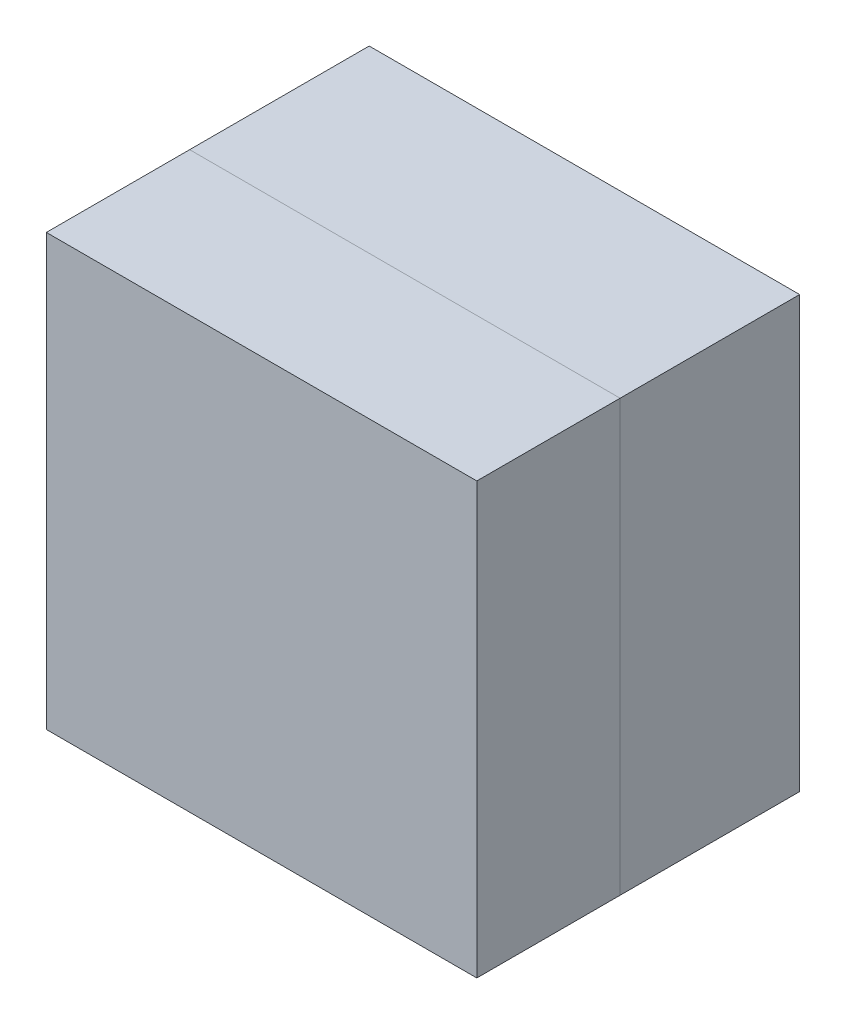
ISO-10303-21;
HEADER;
FILE_DESCRIPTION(('STEP AP214'),'2;1');
FILE_NAME('part.step','',(''),(''),'','','');
FILE_SCHEMA(('AUTOMOTIVE_DESIGN { 1 0 10303 214 1 1 1 1 }'));
ENDSEC;
DATA;
#1=APPLICATION_CONTEXT('core data for automotive mechanical design processes');
#2=APPLICATION_PROTOCOL_DEFINITION('international standard','automotive_design',2000,#1);
#3=PRODUCT_CONTEXT('',#1,'mechanical');
#4=PRODUCT('Part','Part','',(#3));
#5=PRODUCT_RELATED_PRODUCT_CATEGORY('part','',(#4));
#6=PRODUCT_DEFINITION_FORMATION('','',#4);
#7=PRODUCT_DEFINITION_CONTEXT('part definition',#1,'design');
#8=PRODUCT_DEFINITION('design','',#6,#7);
#9=PRODUCT_DEFINITION_SHAPE('','',#8);
#10=(LENGTH_UNIT() NAMED_UNIT(*) SI_UNIT(.MILLI.,.METRE.));
#11=(NAMED_UNIT(*) PLANE_ANGLE_UNIT() SI_UNIT($,.RADIAN.));
#12=(NAMED_UNIT(*) SI_UNIT($,.STERADIAN.) SOLID_ANGLE_UNIT());
#13=UNCERTAINTY_MEASURE_WITH_UNIT(LENGTH_MEASURE(1.E-05),#10,'distance_accuracy_value','');
#14=(GEOMETRIC_REPRESENTATION_CONTEXT(3) GLOBAL_UNCERTAINTY_ASSIGNED_CONTEXT((#13)) GLOBAL_UNIT_ASSIGNED_CONTEXT((#10,
#11,#12)) REPRESENTATION_CONTEXT('',''));
#15=CARTESIAN_POINT('',(0.,0.,0.));
#16=DIRECTION('',(0.,0.,1.));
#17=DIRECTION('',(1.,0.,0.));
#18=AXIS2_PLACEMENT_3D('',#15,#16,#17);
#19=CARTESIAN_POINT('',(0.,-4.61267334725164E-13,127.132943369893));
#20=DIRECTION('',(0.,0.,-1.));
#21=DIRECTION('',(0.,1.,0.));
#22=AXIS2_PLACEMENT_3D('',#19,#20,#21);
#23=PLANE('',#22);
#24=DIRECTION('',(-1.,0.,0.));
#25=VECTOR('',#24,1.);
#26=CARTESIAN_POINT('',(152.4,-152.4,127.132943369892));
#27=LINE('',#26,#25);
#28=CARTESIAN_POINT('',(152.4,-152.4,127.132943369893));
#29=VERTEX_POINT('',#28);
#30=CARTESIAN_POINT('',(-152.4,-152.4,127.132943369892));
#31=VERTEX_POINT('',#30);
#32=EDGE_CURVE('E103',#29,#31,#27,.T.);
#33=ORIENTED_EDGE('',*,*,#32,.T.);
#34=DIRECTION('',(0.,1.,0.));
#35=VECTOR('',#34,1.);
#36=CARTESIAN_POINT('',(-152.4,152.4,127.132943369893));
#37=LINE('',#36,#35);
#38=CARTESIAN_POINT('',(-152.4,152.4,127.132943369893));
#39=VERTEX_POINT('',#38);
#40=EDGE_CURVE('E89',#31,#39,#37,.T.);
#41=ORIENTED_EDGE('',*,*,#40,.T.);
#42=DIRECTION('',(1.,0.,0.));
#43=VECTOR('',#42,1.);
#44=CARTESIAN_POINT('',(152.4,152.4,127.132943369893));
#45=LINE('',#44,#43);
#46=CARTESIAN_POINT('',(152.4,152.4,127.132943369893));
#47=VERTEX_POINT('',#46);
#48=EDGE_CURVE('E101',#39,#47,#45,.T.);
#49=ORIENTED_EDGE('',*,*,#48,.T.);
#50=DIRECTION('',(0.,-1.,0.));
#51=VECTOR('',#50,1.);
#52=CARTESIAN_POINT('',(152.4,152.4,127.132943369893));
#53=LINE('',#52,#51);
#54=EDGE_CURVE('E108',#47,#29,#53,.T.);
#55=ORIENTED_EDGE('',*,*,#54,.T.);
#56=EDGE_LOOP('',(#33,#41,#49,#55));
#57=FACE_BOUND('',#56,.T.);
#58=CARTESIAN_POINT('',(0.90869526163995,-0.0776127525782167,127.132943369893));
#59=DIRECTION('',(0.,0.,1.));
#60=DIRECTION('',(0.,-1.,0.));
#61=AXIS2_PLACEMENT_3D('',#58,#59,#60);
#62=CIRCLE('',#61,91.1860000000005);
#63=CARTESIAN_POINT('',(0.90869526163995,-91.2636127525787,127.132943369892));
#64=VERTEX_POINT('',#63);
#65=EDGE_CURVE('E12',#64,#64,#62,.T.);
#66=ORIENTED_EDGE('',*,*,#65,.T.);
#67=EDGE_LOOP('',(#66));
#68=FACE_BOUND('',#67,.T.);
#69=ADVANCED_FACE('F45',(#57,#68),#23,.T.);
#70=CARTESIAN_POINT('',(0.90869526163995,-138.632902158747,224.450968055005));
#71=DIRECTION('',(0.,0.,-1.));
#72=DIRECTION('',(0.,1.,0.));
#73=AXIS2_PLACEMENT_3D('',#70,#71,#72);
#74=PLANE('',#73);
#75=CARTESIAN_POINT('',(0.90869526163995,-0.0776127525785565,224.450968055006));
#76=DIRECTION('',(0.,0.,1.));
#77=DIRECTION('',(0.,-1.,0.));
#78=AXIS2_PLACEMENT_3D('',#75,#76,#77);
#79=CIRCLE('',#78,138.555289406168);
#80=CARTESIAN_POINT('',(0.90869526163995,-138.632902158747,224.450968055005));
#81=VERTEX_POINT('',#80);
#82=EDGE_CURVE('E144',#81,#81,#79,.T.);
#83=ORIENTED_EDGE('',*,*,#82,.F.);
#84=EDGE_LOOP('',(#83));
#85=FACE_BOUND('',#84,.T.);
#86=ADVANCED_FACE('F158',(#85),#74,.T.);
#87=CARTESIAN_POINT('',(0.90869526163995,-0.0776127525783632,169.085651996013));
#88=DIRECTION('',(0.,0.,1.));
#89=DIRECTION('',(0.,-1.,0.));
#90=AXIS2_PLACEMENT_3D('',#87,#88,#89);
#91=CYLINDRICAL_SURFACE('',#90,138.555289406168);
#92=ORIENTED_EDGE('',*,*,#82,.T.);
#93=EDGE_LOOP('',(#92));
#94=FACE_BOUND('',#93,.T.);
#95=CARTESIAN_POINT('',(0.90869526163995,-0.0776127525785146,212.450968055006));
#96=DIRECTION('',(0.,0.,1.));
#97=DIRECTION('',(0.,-1.,0.));
#98=AXIS2_PLACEMENT_3D('',#95,#96,#97);
#99=CIRCLE('',#98,138.555289406168);
#100=CARTESIAN_POINT('',(0.90869526163995,-138.632902158747,212.450968055005));
#101=VERTEX_POINT('',#100);
#102=EDGE_CURVE('E141',#101,#101,#99,.T.);
#103=ORIENTED_EDGE('',*,*,#102,.F.);
#104=EDGE_LOOP('',(#103));
#105=FACE_BOUND('',#104,.T.);
#106=ADVANCED_FACE('F161',(#94,#105),#91,.F.);
#107=CARTESIAN_POINT('',(0.90869526163995,-0.0776127525785141,212.327662527832));
#108=DIRECTION('',(0.,0.,1.));
#109=DIRECTION('',(0.,-1.,0.));
#110=AXIS2_PLACEMENT_3D('',#107,#108,#109);
#111=TOROIDAL_SURFACE('',#110,134.112,4.44499999999991);
#112=CARTESIAN_POINT('',(0.90869526163995,-0.0776127525784987,207.904943369893));
#113=DIRECTION('',(0.,0.,1.));
#114=DIRECTION('',(0.,-1.,0.));
#115=AXIS2_PLACEMENT_3D('',#112,#113,#114);
#116=CIRCLE('',#115,133.667500000001);
#117=CARTESIAN_POINT('',(0.90869526163995,-133.745112752579,207.904943369892));
#118=VERTEX_POINT('',#117);
#119=EDGE_CURVE('E138',#118,#118,#116,.T.);
#120=ORIENTED_EDGE('',*,*,#119,.F.);
#121=EDGE_LOOP('',(#120));
#122=FACE_BOUND('',#121,.T.);
#123=ORIENTED_EDGE('',*,*,#102,.T.);
#124=EDGE_LOOP('',(#123));
#125=FACE_BOUND('',#124,.T.);
#126=ADVANCED_FACE('F166',(#122,#125),#111,.F.);
#127=CARTESIAN_POINT('',(0.90869526163995,-0.0776127525784766,201.586773144266));
#128=DIRECTION('',(0.,0.,1.));
#129=DIRECTION('',(0.,-1.,0.));
#130=AXIS2_PLACEMENT_3D('',#127,#128,#129);
#131=TOROIDAL_SURFACE('',#130,133.0325,6.34999999999996);
#132=ORIENTED_EDGE('',*,*,#119,.T.);
#133=EDGE_LOOP('',(#132));
#134=FACE_BOUND('',#133,.T.);
#135=CARTESIAN_POINT('',(0.90869526163995,-0.0776127525784766,201.586773144266));
#136=DIRECTION('',(0.,0.,1.));
#137=DIRECTION('',(0.,-1.,0.));
#138=AXIS2_PLACEMENT_3D('',#135,#136,#137);
#139=CIRCLE('',#138,126.6825);
#140=CARTESIAN_POINT('',(0.90869526163995,-126.760112752579,201.586773144265));
#141=VERTEX_POINT('',#140);
#142=EDGE_CURVE('E135',#141,#141,#139,.T.);
#143=ORIENTED_EDGE('',*,*,#142,.F.);
#144=EDGE_LOOP('',(#143));
#145=FACE_BOUND('',#144,.T.);
#146=ADVANCED_FACE('F173',(#134,#145),#131,.T.);
#147=CARTESIAN_POINT('',(0.90869526163995,-0.0776127525783632,169.085651996013));
#148=DIRECTION('',(0.,0.,1.));
#149=DIRECTION('',(0.,-1.,0.));
#150=AXIS2_PLACEMENT_3D('',#147,#148,#149);
#151=CYLINDRICAL_SURFACE('',#150,126.6825);
#152=CARTESIAN_POINT('',(0.90869526163995,-0.0776127525784433,192.029943369893));
#153=DIRECTION('',(0.,0.,1.));
#154=DIRECTION('',(0.,-1.,0.));
#155=AXIS2_PLACEMENT_3D('',#152,#153,#154);
#156=CIRCLE('',#155,126.6825);
#157=CARTESIAN_POINT('',(0.90869526163995,-126.760112752578,192.029943369892));
#158=VERTEX_POINT('',#157);
#159=EDGE_CURVE('E132',#158,#158,#156,.T.);
#160=ORIENTED_EDGE('',*,*,#159,.F.);
#161=EDGE_LOOP('',(#160));
#162=FACE_BOUND('',#161,.T.);
#163=ORIENTED_EDGE('',*,*,#142,.T.);
#164=EDGE_LOOP('',(#163));
#165=FACE_BOUND('',#164,.T.);
#166=ADVANCED_FACE('F177',(#162,#165),#151,.F.);
#167=CARTESIAN_POINT('',(0.90869526163995,-0.0776127525784433,192.029943369893));
#168=DIRECTION('',(0.,0.,1.));
#169=DIRECTION('',(0.,-1.,0.));
#170=AXIS2_PLACEMENT_3D('',#167,#168,#169);
#171=TOROIDAL_SURFACE('',#170,101.2825,25.3999999999999);
#172=CARTESIAN_POINT('',(0.90869526163995,-0.0776127525784355,189.816187504102));
#173=DIRECTION('',(0.,0.,1.));
#174=DIRECTION('',(0.,-1.,0.));
#175=AXIS2_PLACEMENT_3D('',#172,#173,#174);
#176=CIRCLE('',#175,126.58584533153);
#177=CARTESIAN_POINT('',(0.90869526163995,-126.663458084109,189.816187504102));
#178=VERTEX_POINT('',#177);
#179=EDGE_CURVE('E129',#178,#178,#176,.T.);
#180=ORIENTED_EDGE('',*,*,#179,.F.);
#181=EDGE_LOOP('',(#180));
#182=FACE_BOUND('',#181,.T.);
#183=ORIENTED_EDGE('',*,*,#159,.T.);
#184=EDGE_LOOP('',(#183));
#185=FACE_BOUND('',#184,.T.);
#186=ADVANCED_FACE('F181',(#182,#185),#171,.F.);
#187=CARTESIAN_POINT('',(0.90869526163995,-0.0776127525784355,189.816187504102));
#188=DIRECTION('',(0.,0.,1.));
#189=DIRECTION('',(0.,-1.,0.));
#190=AXIS2_PLACEMENT_3D('',#187,#188,#189);
#191=CONICAL_SURFACE('',#190,126.58584533153,0.0872664625997177);
#192=CARTESIAN_POINT('',(0.90869526163995,-0.0776127525783878,176.154943369893));
#193=DIRECTION('',(0.,0.,1.));
#194=DIRECTION('',(0.,-1.,0.));
#195=AXIS2_PLACEMENT_3D('',#192,#193,#194);
#196=CIRCLE('',#195,125.390641340127);
#197=CARTESIAN_POINT('',(0.90869526163995,-125.468254092705,176.154943369892));
#198=VERTEX_POINT('',#197);
#199=EDGE_CURVE('E126',#198,#198,#196,.T.);
#200=ORIENTED_EDGE('',*,*,#199,.F.);
#201=EDGE_LOOP('',(#200));
#202=FACE_BOUND('',#201,.T.);
#203=ORIENTED_EDGE('',*,*,#179,.T.);
#204=EDGE_LOOP('',(#203));
#205=FACE_BOUND('',#204,.T.);
#206=ADVANCED_FACE('F185',(#202,#205),#191,.F.);
#207=CARTESIAN_POINT('',(0.90869526163995,-0.0776127525783936,177.815260269235));
#208=DIRECTION('',(0.,0.,1.));
#209=DIRECTION('',(0.,-1.,0.));
#210=AXIS2_PLACEMENT_3D('',#207,#208,#209);
#211=TOROIDAL_SURFACE('',#210,106.413132341479,19.05);
#212=CARTESIAN_POINT('',(0.90869526163995,-0.0776127525783566,167.222414925144));
#213=DIRECTION('',(0.,0.,1.));
#214=DIRECTION('',(0.,-1.,0.));
#215=AXIS2_PLACEMENT_3D('',#212,#213,#214);
#216=CIRCLE('',#215,122.246455666548);
#217=CARTESIAN_POINT('',(0.90869526163995,-122.324068419126,167.222414925144));
#218=VERTEX_POINT('',#217);
#219=EDGE_CURVE('E123',#218,#218,#216,.T.);
#220=ORIENTED_EDGE('',*,*,#219,.F.);
#221=EDGE_LOOP('',(#220));
#222=FACE_BOUND('',#221,.T.);
#223=ORIENTED_EDGE('',*,*,#199,.T.);
#224=EDGE_LOOP('',(#223));
#225=FACE_BOUND('',#224,.T.);
#226=ADVANCED_FACE('F189',(#222,#225),#211,.F.);
#227=CARTESIAN_POINT('',(0.90869526163995,-0.0776127525783566,167.222414925144));
#228=DIRECTION('',(0.,0.,1.));
#229=DIRECTION('',(0.,-1.,0.));
#230=AXIS2_PLACEMENT_3D('',#227,#228,#229);
#231=CONICAL_SURFACE('',#230,122.246455666548,0.58963160852596);
#232=CARTESIAN_POINT('',(0.90869526163995,-0.077612752578229,130.656757809854));
#233=DIRECTION('',(0.,0.,1.));
#234=DIRECTION('',(0.,-1.,0.));
#235=AXIS2_PLACEMENT_3D('',#232,#233,#234);
#236=CIRCLE('',#235,97.7832180521123);
#237=CARTESIAN_POINT('',(0.90869526163995,-97.8608308046906,130.656757809854));
#238=VERTEX_POINT('',#237);
#239=EDGE_CURVE('E54',#238,#238,#236,.T.);
#240=ORIENTED_EDGE('',*,*,#239,.F.);
#241=EDGE_LOOP('',(#240));
#242=FACE_BOUND('',#241,.T.);
#243=ORIENTED_EDGE('',*,*,#219,.T.);
#244=EDGE_LOOP('',(#243));
#245=FACE_BOUND('',#244,.T.);
#246=ADVANCED_FACE('F193',(#242,#245),#231,.F.);
#247=CARTESIAN_POINT('',(0.90869526163995,-0.0776127525782444,135.070443369893));
#248=DIRECTION('',(0.,0.,1.));
#249=DIRECTION('',(0.,-1.,0.));
#250=AXIS2_PLACEMENT_3D('',#247,#248,#249);
#251=TOROIDAL_SURFACE('',#250,91.1860000000004,7.93750000000004);
#252=ORIENTED_EDGE('',*,*,#65,.F.);
#253=EDGE_LOOP('',(#252));
#254=FACE_BOUND('',#253,.T.);
#255=ORIENTED_EDGE('',*,*,#239,.T.);
#256=EDGE_LOOP('',(#255));
#257=FACE_BOUND('',#256,.T.);
#258=ADVANCED_FACE('F197',(#254,#257),#251,.F.);
#259=CARTESIAN_POINT('',(-152.4,152.4,228.6));
#260=DIRECTION('',(1.,0.,0.));
#261=DIRECTION('',(0.,1.,0.));
#262=AXIS2_PLACEMENT_3D('',#259,#260,#261);
#263=PLANE('',#262);
#264=ORIENTED_EDGE('',*,*,#40,.F.);
#265=DIRECTION('',(0.,0.,-1.));
#266=VECTOR('',#265,1.);
#267=CARTESIAN_POINT('',(-152.4,-152.4,228.6));
#268=LINE('',#267,#266);
#269=CARTESIAN_POINT('',(-152.4,-152.4,228.6));
#270=VERTEX_POINT('',#269);
#271=EDGE_CURVE('E104',#270,#31,#268,.T.);
#272=ORIENTED_EDGE('',*,*,#271,.F.);
#273=DIRECTION('',(0.,-1.,0.));
#274=VECTOR('',#273,1.);
#275=CARTESIAN_POINT('',(-152.4,152.4,228.6));
#276=LINE('',#275,#274);
#277=CARTESIAN_POINT('',(-152.4,152.4,228.6));
#278=VERTEX_POINT('',#277);
#279=EDGE_CURVE('E91',#278,#270,#276,.T.);
#280=ORIENTED_EDGE('',*,*,#279,.F.);
#281=DIRECTION('',(0.,0.,-1.));
#282=VECTOR('',#281,1.);
#283=CARTESIAN_POINT('',(-152.4,152.4,228.6));
#284=LINE('',#283,#282);
#285=EDGE_CURVE('E49',#278,#39,#284,.T.);
#286=ORIENTED_EDGE('',*,*,#285,.T.);
#287=EDGE_LOOP('',(#264,#272,#280,#286));
#288=FACE_BOUND('',#287,.T.);
#289=ADVANCED_FACE('F87',(#288),#263,.F.);
#290=CARTESIAN_POINT('',(152.4,-152.4,228.6));
#291=DIRECTION('',(0.,1.,0.));
#292=DIRECTION('',(-1.,0.,0.));
#293=AXIS2_PLACEMENT_3D('',#290,#291,#292);
#294=PLANE('',#293);
#295=ORIENTED_EDGE('',*,*,#32,.F.);
#296=DIRECTION('',(0.,0.,-1.));
#297=VECTOR('',#296,1.);
#298=CARTESIAN_POINT('',(152.4,-152.4,228.6));
#299=LINE('',#298,#297);
#300=CARTESIAN_POINT('',(152.4,-152.4,228.6));
#301=VERTEX_POINT('',#300);
#302=EDGE_CURVE('E114',#301,#29,#299,.T.);
#303=ORIENTED_EDGE('',*,*,#302,.F.);
#304=DIRECTION('',(1.,0.,0.));
#305=VECTOR('',#304,1.);
#306=CARTESIAN_POINT('',(152.4,-152.4,228.6));
#307=LINE('',#306,#305);
#308=EDGE_CURVE('E62',#270,#301,#307,.T.);
#309=ORIENTED_EDGE('',*,*,#308,.F.);
#310=ORIENTED_EDGE('',*,*,#271,.T.);
#311=EDGE_LOOP('',(#295,#303,#309,#310));
#312=FACE_BOUND('',#311,.T.);
#313=ADVANCED_FACE('F119',(#312),#294,.F.);
#314=CARTESIAN_POINT('',(152.4,152.4,228.6));
#315=DIRECTION('',(-1.,0.,0.));
#316=DIRECTION('',(0.,-1.,0.));
#317=AXIS2_PLACEMENT_3D('',#314,#315,#316);
#318=PLANE('',#317);
#319=ORIENTED_EDGE('',*,*,#54,.F.);
#320=DIRECTION('',(0.,0.,-1.));
#321=VECTOR('',#320,1.);
#322=CARTESIAN_POINT('',(152.4,152.4,228.6));
#323=LINE('',#322,#321);
#324=CARTESIAN_POINT('',(152.4,152.4,228.6));
#325=VERTEX_POINT('',#324);
#326=EDGE_CURVE('E96',#325,#47,#323,.T.);
#327=ORIENTED_EDGE('',*,*,#326,.F.);
#328=DIRECTION('',(0.,1.,0.));
#329=VECTOR('',#328,1.);
#330=CARTESIAN_POINT('',(152.4,152.4,228.6));
#331=LINE('',#330,#329);
#332=EDGE_CURVE('E118',#301,#325,#331,.T.);
#333=ORIENTED_EDGE('',*,*,#332,.F.);
#334=ORIENTED_EDGE('',*,*,#302,.T.);
#335=EDGE_LOOP('',(#319,#327,#333,#334));
#336=FACE_BOUND('',#335,.T.);
#337=ADVANCED_FACE('F117',(#336),#318,.F.);
#338=CARTESIAN_POINT('',(152.4,152.4,228.6));
#339=DIRECTION('',(0.,-1.,0.));
#340=DIRECTION('',(1.,0.,0.));
#341=AXIS2_PLACEMENT_3D('',#338,#339,#340);
#342=PLANE('',#341);
#343=ORIENTED_EDGE('',*,*,#48,.F.);
#344=ORIENTED_EDGE('',*,*,#285,.F.);
#345=DIRECTION('',(-1.,0.,0.));
#346=VECTOR('',#345,1.);
#347=CARTESIAN_POINT('',(152.4,152.4,228.6));
#348=LINE('',#347,#346);
#349=EDGE_CURVE('E95',#325,#278,#348,.T.);
#350=ORIENTED_EDGE('',*,*,#349,.F.);
#351=ORIENTED_EDGE('',*,*,#326,.T.);
#352=EDGE_LOOP('',(#343,#344,#350,#351));
#353=FACE_BOUND('',#352,.T.);
#354=ADVANCED_FACE('F47',(#353),#342,.F.);
#355=CARTESIAN_POINT('',(0.,0.,228.6));
#356=DIRECTION('',(0.,0.,-1.));
#357=DIRECTION('',(-1.,0.,0.));
#358=AXIS2_PLACEMENT_3D('',#355,#356,#357);
#359=PLANE('',#358);
#360=ORIENTED_EDGE('',*,*,#279,.T.);
#361=ORIENTED_EDGE('',*,*,#308,.T.);
#362=ORIENTED_EDGE('',*,*,#332,.T.);
#363=ORIENTED_EDGE('',*,*,#349,.T.);
#364=EDGE_LOOP('',(#360,#361,#362,#363));
#365=FACE_BOUND('',#364,.T.);
#366=ADVANCED_FACE('F150',(#365),#359,.F.);
#367=CLOSED_SHELL('',(#69,#86,#106,#126,#146,#166,#186,#206,#226,#246,#258,#289,#313,#337,#354,#366));
#368=MANIFOLD_SOLID_BREP('B2',#367);
#369=CARTESIAN_POINT('',(0.,-4.61267334725164E-13,127.132943369893));
#370=DIRECTION('',(0.,0.,-1.));
#371=DIRECTION('',(0.,1.,0.));
#372=AXIS2_PLACEMENT_3D('',#369,#370,#371);
#373=PLANE('',#372);
#374=CARTESIAN_POINT('',(0.90869526163995,-0.0776127525782167,127.132943369893));
#375=DIRECTION('',(0.,0.,1.));
#376=DIRECTION('',(0.,-1.,0.));
#377=AXIS2_PLACEMENT_3D('',#374,#375,#376);
#378=CIRCLE('',#377,91.7987750000028);
#379=CARTESIAN_POINT('',(0.90869526163995,-91.876387752581,127.132943369892));
#380=VERTEX_POINT('',#379);
#381=EDGE_CURVE('E384',#380,#380,#378,.T.);
#382=ORIENTED_EDGE('',*,*,#381,.F.);
#383=EDGE_LOOP('',(#382));
#384=FACE_BOUND('',#383,.T.);
#385=DIRECTION('',(-1.,0.,0.));
#386=VECTOR('',#385,1.);
#387=CARTESIAN_POINT('',(152.4,-152.4,127.132943369892));
#388=LINE('',#387,#386);
#389=CARTESIAN_POINT('',(152.4,-152.4,127.132943369893));
#390=VERTEX_POINT('',#389);
#391=CARTESIAN_POINT('',(-152.4,-152.4,127.132943369892));
#392=VERTEX_POINT('',#391);
#393=EDGE_CURVE('E329',#390,#392,#388,.T.);
#394=ORIENTED_EDGE('',*,*,#393,.F.);
#395=DIRECTION('',(0.,-1.,0.));
#396=VECTOR('',#395,1.);
#397=CARTESIAN_POINT('',(152.4,152.4,127.132943369893));
#398=LINE('',#397,#396);
#399=CARTESIAN_POINT('',(152.4,152.4,127.132943369893));
#400=VERTEX_POINT('',#399);
#401=EDGE_CURVE('E342',#400,#390,#398,.T.);
#402=ORIENTED_EDGE('',*,*,#401,.F.);
#403=DIRECTION('',(1.,0.,0.));
#404=VECTOR('',#403,1.);
#405=CARTESIAN_POINT('',(152.4,152.4,127.132943369893));
#406=LINE('',#405,#404);
#407=CARTESIAN_POINT('',(-152.4,152.4,127.132943369893));
#408=VERTEX_POINT('',#407);
#409=EDGE_CURVE('E369',#408,#400,#406,.T.);
#410=ORIENTED_EDGE('',*,*,#409,.F.);
#411=DIRECTION('',(0.,1.,0.));
#412=VECTOR('',#411,1.);
#413=CARTESIAN_POINT('',(-152.4,152.4,127.132943369893));
#414=LINE('',#413,#412);
#415=EDGE_CURVE('E43',#392,#408,#414,.T.);
#416=ORIENTED_EDGE('',*,*,#415,.F.);
#417=EDGE_LOOP('',(#394,#402,#410,#416));
#418=FACE_BOUND('',#417,.T.);
#419=ADVANCED_FACE('F322',(#384,#418),#373,.F.);
#420=CARTESIAN_POINT('',(0.90869526163995,-91.876387752581,127.132943369892));
#421=CARTESIAN_POINT('',(0.90869526163995,-94.6834634015012,127.132943369892));
#422=CARTESIAN_POINT('',(0.90869526163995,-97.40004583746,126.518818236651));
#423=CARTESIAN_POINT('',(0.90869526163995,-99.903113005087,125.348106712939));
#424=(BOUNDED_CURVE() B_SPLINE_CURVE(3,(#420,#421,#422,#423),.UNSPECIFIED.,.F.,
.F.) B_SPLINE_CURVE_WITH_KNOTS((4,4),(0.,1.),
.UNSPECIFIED.) CURVE() GEOMETRIC_REPRESENTATION_ITEM() RATIONAL_B_SPLINE_CURVE((0.254333095030252,
0.254333095030252,0.258499793724843,0.266833191114025)) REPRESENTATION_ITEM(''));
#425=CARTESIAN_POINT('',(0.90869526163995,-0.0776127525783632,169.085651996013));
#426=DIRECTION('',(0.,0.,1.));
#427=AXIS1_PLACEMENT('',#425,#426);
#428=SURFACE_OF_REVOLUTION('',#424,#427);
#429=CARTESIAN_POINT('',(0.90869526163995,-0.0776127525782104,125.348106712939));
#430=DIRECTION('',(0.,0.,1.));
#431=DIRECTION('',(0.,-1.,0.));
#432=AXIS2_PLACEMENT_3D('',#429,#430,#431);
#433=CIRCLE('',#432,99.8255002525088);
#434=CARTESIAN_POINT('',(0.90869526163995,-99.903113005087,125.348106712939));
#435=VERTEX_POINT('',#434);
#436=EDGE_CURVE('E387',#435,#435,#433,.T.);
#437=ORIENTED_EDGE('',*,*,#436,.F.);
#438=EDGE_LOOP('',(#437));
#439=FACE_BOUND('',#438,.T.);
#440=ORIENTED_EDGE('',*,*,#381,.T.);
#441=EDGE_LOOP('',(#440));
#442=FACE_BOUND('',#441,.T.);
#443=ADVANCED_FACE('F412',(#439,#442),#428,.T.);
#444=CARTESIAN_POINT('',(0.90869526163995,-0.077612752578179,116.353347557886));
#445=DIRECTION('',(0.,0.,-1.));
#446=DIRECTION('',(0.,1.,0.));
#447=AXIS2_PLACEMENT_3D('',#444,#445,#446);
#448=CONICAL_SURFACE('',#447,119.056955539065,1.13331210913777);
#449=ORIENTED_EDGE('',*,*,#436,.T.);
#450=EDGE_LOOP('',(#449));
#451=FACE_BOUND('',#450,.T.);
#452=CARTESIAN_POINT('',(0.90869526163995,-0.077612752578179,116.353347557886));
#453=DIRECTION('',(0.,0.,1.));
#454=DIRECTION('',(0.,-1.,0.));
#455=AXIS2_PLACEMENT_3D('',#452,#453,#454);
#456=CIRCLE('',#455,119.056955539065);
#457=CARTESIAN_POINT('',(0.90869526163995,-119.134568291643,116.353347557886));
#458=VERTEX_POINT('',#457);
#459=EDGE_CURVE('E460',#458,#458,#456,.T.);
#460=ORIENTED_EDGE('',*,*,#459,.F.);
#461=EDGE_LOOP('',(#460));
#462=FACE_BOUND('',#461,.T.);
#463=ADVANCED_FACE('F417',(#451,#462),#448,.F.);
#464=CARTESIAN_POINT('',(0.90869526163995,-0.0776127525781537,109.10678459855));
#465=DIRECTION('',(0.,0.,1.));
#466=DIRECTION('',(0.,-1.,0.));
#467=AXIS2_PLACEMENT_3D('',#464,#465,#466);
#468=TOROIDAL_SURFACE('',#467,115.667659848753,8.);
#469=ORIENTED_EDGE('',*,*,#459,.T.);
#470=EDGE_LOOP('',(#469));
#471=FACE_BOUND('',#470,.T.);
#472=CARTESIAN_POINT('',(0.90869526163995,-0.0776127525781548,109.41388707125));
#473=DIRECTION('',(0.,0.,1.));
#474=DIRECTION('',(0.,-1.,0.));
#475=AXIS2_PLACEMENT_3D('',#472,#473,#474);
#476=CIRCLE('',#475,123.661763180038);
#477=CARTESIAN_POINT('',(0.90869526163995,-123.739375932616,109.413887071249));
#478=VERTEX_POINT('',#477);
#479=EDGE_CURVE('E457',#478,#478,#476,.T.);
#480=ORIENTED_EDGE('',*,*,#479,.F.);
#481=EDGE_LOOP('',(#480));
#482=FACE_BOUND('',#481,.T.);
#483=ADVANCED_FACE('F468',(#471,#482),#468,.F.);
#484=CARTESIAN_POINT('',(0.90869526163995,-0.0776127525779172,41.3463400319306));
#485=DIRECTION('',(0.,0.,-1.));
#486=DIRECTION('',(0.,1.,0.));
#487=AXIS2_PLACEMENT_3D('',#484,#485,#486);
#488=CONICAL_SURFACE('',#487,126.276654574374,0.0383972435438753);
#489=ORIENTED_EDGE('',*,*,#479,.T.);
#490=EDGE_LOOP('',(#489));
#491=FACE_BOUND('',#490,.T.);
#492=CARTESIAN_POINT('',(0.90869526163995,-0.0776127525779172,41.3463400319306));
#493=DIRECTION('',(0.,0.,1.));
#494=DIRECTION('',(0.,-1.,0.));
#495=AXIS2_PLACEMENT_3D('',#492,#493,#494);
#496=CIRCLE('',#495,126.276654574374);
#497=CARTESIAN_POINT('',(0.90869526163995,-126.354267326952,41.3463400319301));
#498=VERTEX_POINT('',#497);
#499=EDGE_CURVE('E454',#498,#498,#496,.T.);
#500=ORIENTED_EDGE('',*,*,#499,.F.);
#501=EDGE_LOOP('',(#500));
#502=FACE_BOUND('',#501,.T.);
#503=ADVANCED_FACE('F473',(#491,#502),#488,.F.);
#504=CARTESIAN_POINT('',(0.90869526163995,-0.0776127525779125,40.0027667138672));
#505=DIRECTION('',(0.,0.,1.));
#506=DIRECTION('',(0.,-1.,0.));
#507=AXIS2_PLACEMENT_3D('',#504,#505,#506);
#508=TOROIDAL_SURFACE('',#507,91.302452500002,35.);
#509=ORIENTED_EDGE('',*,*,#499,.T.);
#510=EDGE_LOOP('',(#509));
#511=FACE_BOUND('',#510,.T.);
#512=CARTESIAN_POINT('',(0.90869526163995,-0.0776127525779125,40.0027667138671));
#513=DIRECTION('',(0.,0.,1.));
#514=DIRECTION('',(0.,-1.,0.));
#515=AXIS2_PLACEMENT_3D('',#512,#513,#514);
#516=CIRCLE('',#515,126.302452500002);
#517=CARTESIAN_POINT('',(0.90869526163995,-126.38006525258,40.0027667138667));
#518=VERTEX_POINT('',#517);
#519=EDGE_CURVE('E451',#518,#518,#516,.T.);
#520=ORIENTED_EDGE('',*,*,#519,.F.);
#521=EDGE_LOOP('',(#520));
#522=FACE_BOUND('',#521,.T.);
#523=ADVANCED_FACE('F478',(#511,#522),#508,.F.);
#524=CARTESIAN_POINT('',(0.90869526163995,-0.0776127525783632,169.085651996013));
#525=DIRECTION('',(0.,0.,1.));
#526=DIRECTION('',(0.,-1.,0.));
#527=AXIS2_PLACEMENT_3D('',#524,#525,#526);
#528=CYLINDRICAL_SURFACE('',#527,126.302452500002);
#529=CARTESIAN_POINT('',(0.90869526163995,-0.0776127525778679,27.2484054174911));
#530=DIRECTION('',(0.,0.,1.));
#531=DIRECTION('',(0.,-1.,0.));
#532=AXIS2_PLACEMENT_3D('',#529,#530,#531);
#533=CIRCLE('',#532,126.302452500002);
#534=CARTESIAN_POINT('',(0.90869526163995,-126.38006525258,27.2484054174907));
#535=VERTEX_POINT('',#534);
#536=EDGE_CURVE('E448',#535,#535,#533,.T.);
#537=ORIENTED_EDGE('',*,*,#536,.F.);
#538=EDGE_LOOP('',(#537));
#539=FACE_BOUND('',#538,.T.);
#540=ORIENTED_EDGE('',*,*,#519,.T.);
#541=EDGE_LOOP('',(#540));
#542=FACE_BOUND('',#541,.T.);
#543=ADVANCED_FACE('F484',(#539,#542),#528,.F.);
#544=CARTESIAN_POINT('',(0.90869526163995,-133.59734825258,20.9609433698914));
#545=CARTESIAN_POINT('',(0.90869526163995,-128.912310640584,20.2965209052261));
#546=CARTESIAN_POINT('',(0.90869526163995,-126.38006525258,23.7261671924004));
#547=CARTESIAN_POINT('',(0.90869526163995,-126.38006525258,27.2484054174907));
#548=(BOUNDED_CURVE() B_SPLINE_CURVE(3,(#544,#545,#546,#547),.UNSPECIFIED.,.F.,
.F.) B_SPLINE_CURVE_WITH_KNOTS((4,4),(0.,1.),
.UNSPECIFIED.) CURVE() GEOMETRIC_REPRESENTATION_ITEM() RATIONAL_B_SPLINE_CURVE((0.255591691964593,
0.242825015050018,0.327183181081988,0.508666190060503)) REPRESENTATION_ITEM(''));
#549=CARTESIAN_POINT('',(0.90869526163995,-0.0776127525783632,169.085651996013));
#550=DIRECTION('',(0.,0.,1.));
#551=AXIS1_PLACEMENT('',#549,#550);
#552=SURFACE_OF_REVOLUTION('',#548,#551);
#553=ORIENTED_EDGE('',*,*,#536,.T.);
#554=EDGE_LOOP('',(#553));
#555=FACE_BOUND('',#554,.T.);
#556=CARTESIAN_POINT('',(0.90869526163995,-0.077612752577846,20.9609433698918));
#557=DIRECTION('',(0.,0.,1.));
#558=DIRECTION('',(0.,-1.,0.));
#559=AXIS2_PLACEMENT_3D('',#556,#557,#558);
#560=CIRCLE('',#559,133.519735500002);
#561=CARTESIAN_POINT('',(0.90869526163995,-133.59734825258,20.9609433698914));
#562=VERTEX_POINT('',#561);
#563=EDGE_CURVE('E445',#562,#562,#560,.T.);
#564=ORIENTED_EDGE('',*,*,#563,.F.);
#565=EDGE_LOOP('',(#564));
#566=FACE_BOUND('',#565,.T.);
#567=ADVANCED_FACE('F489',(#555,#566),#552,.F.);
#568=CARTESIAN_POINT('',(0.90869526163995,-133.59734825258,20.9609433698914));
#569=CARTESIAN_POINT('',(0.90869526163995,-136.783173828737,21.4127506458637));
#570=CARTESIAN_POINT('',(0.90869526163995,-138.50510069258,19.0805911705852));
#571=CARTESIAN_POINT('',(0.90869526163995,-138.50510069258,16.685469177524));
#572=(BOUNDED_CURVE() B_SPLINE_CURVE(3,(#568,#569,#570,#571),.UNSPECIFIED.,.F.,
.F.) B_SPLINE_CURVE_WITH_KNOTS((4,4),(0.,1.),
.UNSPECIFIED.) CURVE() GEOMETRIC_REPRESENTATION_ITEM() RATIONAL_B_SPLINE_CURVE((0.255591691964592,
0.242825015050017,0.327183181081988,0.508666190060503)) REPRESENTATION_ITEM(''));
#573=CARTESIAN_POINT('',(0.90869526163995,-0.0776127525783632,169.085651996013));
#574=DIRECTION('',(0.,0.,1.));
#575=AXIS1_PLACEMENT('',#573,#574);
#576=SURFACE_OF_REVOLUTION('',#572,#575);
#577=CARTESIAN_POINT('',(0.90869526163995,-0.0776127525778311,16.6854691775245));
#578=DIRECTION('',(0.,0.,1.));
#579=DIRECTION('',(0.,-1.,0.));
#580=AXIS2_PLACEMENT_3D('',#577,#578,#579);
#581=CIRCLE('',#580,138.427487940002);
#582=CARTESIAN_POINT('',(0.90869526163995,-138.50510069258,16.685469177524));
#583=VERTEX_POINT('',#582);
#584=EDGE_CURVE('E442',#583,#583,#581,.T.);
#585=ORIENTED_EDGE('',*,*,#584,.F.);
#586=EDGE_LOOP('',(#585));
#587=FACE_BOUND('',#586,.T.);
#588=ORIENTED_EDGE('',*,*,#563,.T.);
#589=EDGE_LOOP('',(#588));
#590=FACE_BOUND('',#589,.T.);
#591=ADVANCED_FACE('F495',(#587,#590),#576,.T.);
#592=CARTESIAN_POINT('',(0.90869526163995,-0.0776127525783632,169.085651996013));
#593=DIRECTION('',(0.,0.,1.));
#594=DIRECTION('',(0.,-1.,0.));
#595=AXIS2_PLACEMENT_3D('',#592,#593,#594);
#596=CYLINDRICAL_SURFACE('',#595,138.427487940002);
#597=CARTESIAN_POINT('',(0.90869526163995,-0.0776127525777892,4.68546917752451));
#598=DIRECTION('',(0.,0.,1.));
#599=DIRECTION('',(0.,-1.,0.));
#600=AXIS2_PLACEMENT_3D('',#597,#598,#599);
#601=CIRCLE('',#600,138.427487940002);
#602=CARTESIAN_POINT('',(0.90869526163995,-138.50510069258,4.68546917752402));
#603=VERTEX_POINT('',#602);
#604=EDGE_CURVE('E436',#603,#603,#601,.T.);
#605=ORIENTED_EDGE('',*,*,#604,.F.);
#606=EDGE_LOOP('',(#605));
#607=FACE_BOUND('',#606,.T.);
#608=ORIENTED_EDGE('',*,*,#584,.T.);
#609=EDGE_LOOP('',(#608));
#610=FACE_BOUND('',#609,.T.);
#611=ADVANCED_FACE('F502',(#607,#610),#596,.F.);
#612=CARTESIAN_POINT('',(0.90869526163995,-138.50510069258,4.68546917752402));
#613=DIRECTION('',(0.,0.,-1.));
#614=DIRECTION('',(0.,1.,0.));
#615=AXIS2_PLACEMENT_3D('',#612,#613,#614);
#616=PLANE('',#615);
#617=ORIENTED_EDGE('',*,*,#604,.T.);
#618=EDGE_LOOP('',(#617));
#619=FACE_BOUND('',#618,.T.);
#620=ADVANCED_FACE('F512',(#619),#616,.F.);
#621=CARTESIAN_POINT('',(152.4,-152.4,228.6));
#622=DIRECTION('',(0.,1.,0.));
#623=DIRECTION('',(-1.,0.,0.));
#624=AXIS2_PLACEMENT_3D('',#621,#622,#623);
#625=PLANE('',#624);
#626=DIRECTION('',(0.,0.,-1.));
#627=VECTOR('',#626,1.);
#628=CARTESIAN_POINT('',(152.4,-152.4,228.6));
#629=LINE('',#628,#627);
#630=CARTESIAN_POINT('',(152.4,-152.4,0.));
#631=VERTEX_POINT('',#630);
#632=EDGE_CURVE('E370',#390,#631,#629,.T.);
#633=ORIENTED_EDGE('',*,*,#632,.F.);
#634=ORIENTED_EDGE('',*,*,#393,.T.);
#635=DIRECTION('',(0.,0.,-1.));
#636=VECTOR('',#635,1.);
#637=CARTESIAN_POINT('',(-152.4,-152.4,228.6));
#638=LINE('',#637,#636);
#639=CARTESIAN_POINT('',(-152.4,-152.4,0.));
#640=VERTEX_POINT('',#639);
#641=EDGE_CURVE('E361',#392,#640,#638,.T.);
#642=ORIENTED_EDGE('',*,*,#641,.T.);
#643=DIRECTION('',(1.,0.,0.));
#644=VECTOR('',#643,1.);
#645=CARTESIAN_POINT('',(152.4,-152.4,0.));
#646=LINE('',#645,#644);
#647=EDGE_CURVE('E365',#640,#631,#646,.T.);
#648=ORIENTED_EDGE('',*,*,#647,.T.);
#649=EDGE_LOOP('',(#633,#634,#642,#648));
#650=FACE_BOUND('',#649,.T.);
#651=ADVANCED_FACE('F364',(#650),#625,.F.);
#652=CARTESIAN_POINT('',(0.,0.,0.));
#653=DIRECTION('',(0.,0.,-1.));
#654=DIRECTION('',(-1.,0.,0.));
#655=AXIS2_PLACEMENT_3D('',#652,#653,#654);
#656=PLANE('',#655);
#657=DIRECTION('',(0.,-1.,0.));
#658=VECTOR('',#657,1.);
#659=CARTESIAN_POINT('',(-152.4,152.4,0.));
#660=LINE('',#659,#658);
#661=CARTESIAN_POINT('',(-152.4,152.4,0.));
#662=VERTEX_POINT('',#661);
#663=EDGE_CURVE('E376',#662,#640,#660,.T.);
#664=ORIENTED_EDGE('',*,*,#663,.F.);
#665=DIRECTION('',(-1.,0.,0.));
#666=VECTOR('',#665,1.);
#667=CARTESIAN_POINT('',(152.4,152.4,0.));
#668=LINE('',#667,#666);
#669=CARTESIAN_POINT('',(152.4,152.4,0.));
#670=VERTEX_POINT('',#669);
#671=EDGE_CURVE('E392',#670,#662,#668,.T.);
#672=ORIENTED_EDGE('',*,*,#671,.F.);
#673=DIRECTION('',(0.,1.,0.));
#674=VECTOR('',#673,1.);
#675=CARTESIAN_POINT('',(152.4,152.4,0.));
#676=LINE('',#675,#674);
#677=EDGE_CURVE('E378',#631,#670,#676,.T.);
#678=ORIENTED_EDGE('',*,*,#677,.F.);
#679=ORIENTED_EDGE('',*,*,#647,.F.);
#680=EDGE_LOOP('',(#664,#672,#678,#679));
#681=FACE_BOUND('',#680,.T.);
#682=ADVANCED_FACE('F374',(#681),#656,.T.);
#683=CARTESIAN_POINT('',(152.4,152.4,228.6));
#684=DIRECTION('',(-1.,0.,0.));
#685=DIRECTION('',(0.,-1.,0.));
#686=AXIS2_PLACEMENT_3D('',#683,#684,#685);
#687=PLANE('',#686);
#688=DIRECTION('',(0.,0.,-1.));
#689=VECTOR('',#688,1.);
#690=CARTESIAN_POINT('',(152.4,152.4,228.6));
#691=LINE('',#690,#689);
#692=EDGE_CURVE('E395',#400,#670,#691,.T.);
#693=ORIENTED_EDGE('',*,*,#692,.F.);
#694=ORIENTED_EDGE('',*,*,#401,.T.);
#695=ORIENTED_EDGE('',*,*,#632,.T.);
#696=ORIENTED_EDGE('',*,*,#677,.T.);
#697=EDGE_LOOP('',(#693,#694,#695,#696));
#698=FACE_BOUND('',#697,.T.);
#699=ADVANCED_FACE('F401',(#698),#687,.F.);
#700=CARTESIAN_POINT('',(-152.4,152.4,228.6));
#701=DIRECTION('',(1.,0.,0.));
#702=DIRECTION('',(0.,1.,0.));
#703=AXIS2_PLACEMENT_3D('',#700,#701,#702);
#704=PLANE('',#703);
#705=ORIENTED_EDGE('',*,*,#641,.F.);
#706=ORIENTED_EDGE('',*,*,#415,.T.);
#707=DIRECTION('',(0.,0.,-1.));
#708=VECTOR('',#707,1.);
#709=CARTESIAN_POINT('',(-152.4,152.4,228.6));
#710=LINE('',#709,#708);
#711=EDGE_CURVE('E382',#408,#662,#710,.T.);
#712=ORIENTED_EDGE('',*,*,#711,.T.);
#713=ORIENTED_EDGE('',*,*,#663,.T.);
#714=EDGE_LOOP('',(#705,#706,#712,#713));
#715=FACE_BOUND('',#714,.T.);
#716=ADVANCED_FACE('F380',(#715),#704,.F.);
#717=CARTESIAN_POINT('',(152.4,152.4,228.6));
#718=DIRECTION('',(0.,-1.,0.));
#719=DIRECTION('',(1.,0.,0.));
#720=AXIS2_PLACEMENT_3D('',#717,#718,#719);
#721=PLANE('',#720);
#722=ORIENTED_EDGE('',*,*,#711,.F.);
#723=ORIENTED_EDGE('',*,*,#409,.T.);
#724=ORIENTED_EDGE('',*,*,#692,.T.);
#725=ORIENTED_EDGE('',*,*,#671,.T.);
#726=EDGE_LOOP('',(#722,#723,#724,#725));
#727=FACE_BOUND('',#726,.T.);
#728=ADVANCED_FACE('F400',(#727),#721,.F.);
#729=CLOSED_SHELL('',(#419,#443,#463,#483,#503,#523,#543,#567,#591,#611,#620,#651,#682,#699,
#716,#728));
#730=MANIFOLD_SOLID_BREP('B6',#729);
#731=ADVANCED_BREP_SHAPE_REPRESENTATION('',(#18,#368,#730),#14);
#732=SHAPE_DEFINITION_REPRESENTATION(#9,#731);
ENDSEC;
END-ISO-10303-21;
